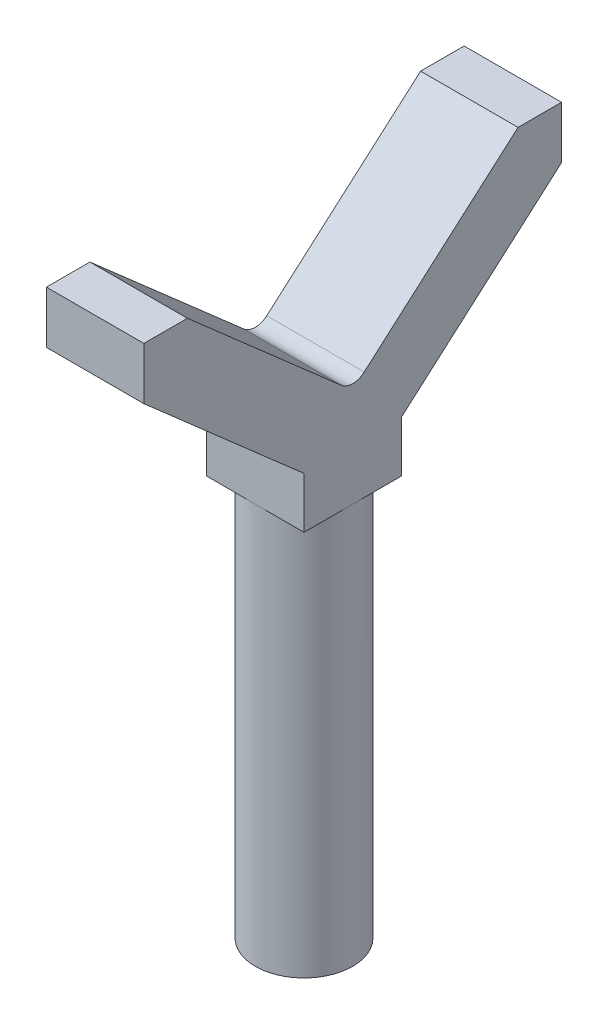
ISO-10303-21;
HEADER;
FILE_DESCRIPTION(('STEP AP214'),'2;1');
FILE_NAME('part.step','',(''),(''),'','','');
FILE_SCHEMA(('AUTOMOTIVE_DESIGN { 1 0 10303 214 1 1 1 1 }'));
ENDSEC;
DATA;
#1=APPLICATION_CONTEXT('core data for automotive mechanical design processes');
#2=APPLICATION_PROTOCOL_DEFINITION('international standard','automotive_design',2000,#1);
#3=PRODUCT_CONTEXT('',#1,'mechanical');
#4=PRODUCT('Part','Part','',(#3));
#5=PRODUCT_RELATED_PRODUCT_CATEGORY('part','',(#4));
#6=PRODUCT_DEFINITION_FORMATION('','',#4);
#7=PRODUCT_DEFINITION_CONTEXT('part definition',#1,'design');
#8=PRODUCT_DEFINITION('design','',#6,#7);
#9=PRODUCT_DEFINITION_SHAPE('','',#8);
#10=(LENGTH_UNIT() NAMED_UNIT(*) SI_UNIT(.MILLI.,.METRE.));
#11=(NAMED_UNIT(*) PLANE_ANGLE_UNIT() SI_UNIT($,.RADIAN.));
#12=(NAMED_UNIT(*) SI_UNIT($,.STERADIAN.) SOLID_ANGLE_UNIT());
#13=UNCERTAINTY_MEASURE_WITH_UNIT(LENGTH_MEASURE(1.E-05),#10,'distance_accuracy_value','');
#14=(GEOMETRIC_REPRESENTATION_CONTEXT(3) GLOBAL_UNCERTAINTY_ASSIGNED_CONTEXT((#13)) GLOBAL_UNIT_ASSIGNED_CONTEXT((#10,
#11,#12)) REPRESENTATION_CONTEXT('',''));
#15=CARTESIAN_POINT('',(0.,0.,0.));
#16=DIRECTION('',(0.,0.,1.));
#17=DIRECTION('',(1.,0.,0.));
#18=AXIS2_PLACEMENT_3D('',#15,#16,#17);
#19=CARTESIAN_POINT('',(0.,230.,0.));
#20=DIRECTION('',(0.,-1.,0.));
#21=DIRECTION('',(0.,0.,-1.));
#22=AXIS2_PLACEMENT_3D('',#19,#20,#21);
#23=CYLINDRICAL_SURFACE('',#22,28.);
#24=CARTESIAN_POINT('',(0.,230.,0.));
#25=DIRECTION('',(0.,1.,0.));
#26=DIRECTION('',(0.,0.,1.));
#27=AXIS2_PLACEMENT_3D('',#24,#25,#26);
#28=CIRCLE('',#27,28.);
#29=CARTESIAN_POINT('',(0.,230.,28.));
#30=VERTEX_POINT('',#29);
#31=CARTESIAN_POINT('',(28.,230.,0.));
#32=VERTEX_POINT('',#31);
#33=EDGE_CURVE('E11',#30,#32,#28,.T.);
#34=ORIENTED_EDGE('',*,*,#33,.F.);
#35=CARTESIAN_POINT('',(-28.,230.,0.));
#36=VERTEX_POINT('',#35);
#37=EDGE_CURVE('E45',#36,#30,#28,.T.);
#38=ORIENTED_EDGE('',*,*,#37,.F.);
#39=CARTESIAN_POINT('',(0.,230.,-28.));
#40=VERTEX_POINT('',#39);
#41=EDGE_CURVE('E55',#40,#36,#28,.T.);
#42=ORIENTED_EDGE('',*,*,#41,.F.);
#43=EDGE_CURVE('E44',#32,#40,#28,.T.);
#44=ORIENTED_EDGE('',*,*,#43,.F.);
#45=EDGE_LOOP('',(#34,#38,#42,#44));
#46=FACE_BOUND('',#45,.T.);
#47=CARTESIAN_POINT('',(0.,0.,0.));
#48=DIRECTION('',(0.,1.,0.));
#49=DIRECTION('',(0.,0.,1.));
#50=AXIS2_PLACEMENT_3D('',#47,#48,#49);
#51=CIRCLE('',#50,28.);
#52=CARTESIAN_POINT('',(0.,0.,28.));
#53=VERTEX_POINT('',#52);
#54=EDGE_CURVE('E39',#53,#53,#51,.T.);
#55=ORIENTED_EDGE('',*,*,#54,.T.);
#56=EDGE_LOOP('',(#55));
#57=FACE_BOUND('',#56,.T.);
#58=ADVANCED_FACE('F36',(#46,#57),#23,.T.);
#59=CARTESIAN_POINT('',(0.,0.,0.));
#60=DIRECTION('',(0.,1.,0.));
#61=DIRECTION('',(0.,0.,1.));
#62=AXIS2_PLACEMENT_3D('',#59,#60,#61);
#63=PLANE('',#62);
#64=ORIENTED_EDGE('',*,*,#54,.F.);
#65=EDGE_LOOP('',(#64));
#66=FACE_BOUND('',#65,.T.);
#67=ADVANCED_FACE('F308',(#66),#63,.F.);
#68=CARTESIAN_POINT('',(28.,230.,-28.));
#69=DIRECTION('',(0.,1.,0.));
#70=DIRECTION('',(0.,0.,1.));
#71=AXIS2_PLACEMENT_3D('',#68,#69,#70);
#72=PLANE('',#71);
#73=DIRECTION('',(-1.,0.,0.));
#74=VECTOR('',#73,1.);
#75=CARTESIAN_POINT('',(28.,230.,28.));
#76=LINE('',#75,#74);
#77=CARTESIAN_POINT('',(28.,230.,28.));
#78=VERTEX_POINT('',#77);
#79=EDGE_CURVE('E173',#78,#30,#76,.T.);
#80=ORIENTED_EDGE('',*,*,#79,.T.);
#81=ORIENTED_EDGE('',*,*,#33,.T.);
#82=DIRECTION('',(0.,0.,-1.));
#83=VECTOR('',#82,1.);
#84=CARTESIAN_POINT('',(28.,230.,-28.));
#85=LINE('',#84,#83);
#86=EDGE_CURVE('E229',#78,#32,#85,.T.);
#87=ORIENTED_EDGE('',*,*,#86,.F.);
#88=EDGE_LOOP('',(#80,#81,#87));
#89=FACE_BOUND('',#88,.T.);
#90=ADVANCED_FACE('F260',(#89),#72,.F.);
#91=CARTESIAN_POINT('',(28.,230.,-28.));
#92=VERTEX_POINT('',#91);
#93=EDGE_CURVE('E232',#32,#92,#85,.T.);
#94=ORIENTED_EDGE('',*,*,#93,.F.);
#95=ORIENTED_EDGE('',*,*,#43,.T.);
#96=DIRECTION('',(-1.,0.,0.));
#97=VECTOR('',#96,1.);
#98=CARTESIAN_POINT('',(28.,230.,-28.));
#99=LINE('',#98,#97);
#100=EDGE_CURVE('E177',#92,#40,#99,.T.);
#101=ORIENTED_EDGE('',*,*,#100,.F.);
#102=EDGE_LOOP('',(#94,#95,#101));
#103=FACE_BOUND('',#102,.T.);
#104=ADVANCED_FACE('F264',(#103),#72,.F.);
#105=CARTESIAN_POINT('',(-28.,230.,-28.));
#106=VERTEX_POINT('',#105);
#107=EDGE_CURVE('E180',#40,#106,#99,.T.);
#108=ORIENTED_EDGE('',*,*,#107,.F.);
#109=ORIENTED_EDGE('',*,*,#41,.T.);
#110=DIRECTION('',(0.,0.,-1.));
#111=VECTOR('',#110,1.);
#112=CARTESIAN_POINT('',(-28.,230.,-28.));
#113=LINE('',#112,#111);
#114=EDGE_CURVE('E207',#36,#106,#113,.T.);
#115=ORIENTED_EDGE('',*,*,#114,.T.);
#116=EDGE_LOOP('',(#108,#109,#115));
#117=FACE_BOUND('',#116,.T.);
#118=ADVANCED_FACE('F298',(#117),#72,.F.);
#119=CARTESIAN_POINT('',(-28.,230.,28.));
#120=VERTEX_POINT('',#119);
#121=EDGE_CURVE('E204',#120,#36,#113,.T.);
#122=ORIENTED_EDGE('',*,*,#121,.T.);
#123=ORIENTED_EDGE('',*,*,#37,.T.);
#124=EDGE_CURVE('E176',#30,#120,#76,.T.);
#125=ORIENTED_EDGE('',*,*,#124,.T.);
#126=EDGE_LOOP('',(#122,#123,#125));
#127=FACE_BOUND('',#126,.T.);
#128=ADVANCED_FACE('F296',(#127),#72,.F.);
#129=CARTESIAN_POINT('',(28.,300.,0.));
#130=DIRECTION('',(-1.,0.,0.));
#131=DIRECTION('',(0.,0.,1.));
#132=AXIS2_PLACEMENT_3D('',#129,#130,#131);
#133=CYLINDRICAL_SURFACE('',#132,10.0000000000001);
#134=CARTESIAN_POINT('',(-28.,300.,0.));
#135=DIRECTION('',(-1.,0.,0.));
#136=DIRECTION('',(0.,0.,-1.));
#137=AXIS2_PLACEMENT_3D('',#134,#135,#136);
#138=CIRCLE('',#137,10.0000000000001);
#139=CARTESIAN_POINT('',(-28.,292.481093561587,-6.59287842830408));
#140=VERTEX_POINT('',#139);
#141=CARTESIAN_POINT('',(-28.,292.481093561587,6.59287842830408));
#142=VERTEX_POINT('',#141);
#143=EDGE_CURVE('E159',#140,#142,#138,.T.);
#144=ORIENTED_EDGE('',*,*,#143,.T.);
#145=DIRECTION('',(-1.,0.,0.));
#146=VECTOR('',#145,1.);
#147=CARTESIAN_POINT('',(28.,292.481093561587,6.59287842830408));
#148=LINE('',#147,#146);
#149=CARTESIAN_POINT('',(28.,292.481093561587,6.59287842830408));
#150=VERTEX_POINT('',#149);
#151=EDGE_CURVE('E139',#150,#142,#148,.T.);
#152=ORIENTED_EDGE('',*,*,#151,.F.);
#153=CARTESIAN_POINT('',(28.,300.,0.));
#154=DIRECTION('',(-1.,0.,0.));
#155=DIRECTION('',(0.,0.,-1.));
#156=AXIS2_PLACEMENT_3D('',#153,#154,#155);
#157=CIRCLE('',#156,10.0000000000001);
#158=CARTESIAN_POINT('',(28.,292.481093561587,-6.59287842830408));
#159=VERTEX_POINT('',#158);
#160=EDGE_CURVE('E146',#159,#150,#157,.T.);
#161=ORIENTED_EDGE('',*,*,#160,.F.);
#162=DIRECTION('',(-1.,0.,0.));
#163=VECTOR('',#162,1.);
#164=CARTESIAN_POINT('',(28.,292.481093561587,-6.59287842830408));
#165=LINE('',#164,#163);
#166=EDGE_CURVE('E193',#159,#140,#165,.T.);
#167=ORIENTED_EDGE('',*,*,#166,.T.);
#168=EDGE_LOOP('',(#144,#152,#161,#167));
#169=FACE_BOUND('',#168,.T.);
#170=ADVANCED_FACE('F157',(#169),#133,.F.);
#171=CARTESIAN_POINT('',(28.,292.481093561587,6.59287842830408));
#172=DIRECTION('',(0.,-0.751890643841264,0.659287842830406));
#173=DIRECTION('',(0.,-0.659287842830406,-0.751890643841264));
#174=AXIS2_PLACEMENT_3D('',#171,#172,#173);
#175=PLANE('',#174);
#176=DIRECTION('',(0.,0.659287842830406,0.751890643841264));
#177=VECTOR('',#176,1.);
#178=CARTESIAN_POINT('',(-28.,292.481093561587,6.59287842830408));
#179=LINE('',#178,#177);
#180=CARTESIAN_POINT('',(-28.,370.,95.));
#181=VERTEX_POINT('',#180);
#182=EDGE_CURVE('E217',#142,#181,#179,.T.);
#183=ORIENTED_EDGE('',*,*,#182,.T.);
#184=DIRECTION('',(-1.,0.,0.));
#185=VECTOR('',#184,1.);
#186=CARTESIAN_POINT('',(28.,370.,95.));
#187=LINE('',#186,#185);
#188=CARTESIAN_POINT('',(28.,370.,95.));
#189=VERTEX_POINT('',#188);
#190=EDGE_CURVE('E142',#189,#181,#187,.T.);
#191=ORIENTED_EDGE('',*,*,#190,.F.);
#192=DIRECTION('',(0.,0.659287842830406,0.751890643841264));
#193=VECTOR('',#192,1.);
#194=CARTESIAN_POINT('',(28.,292.481093561587,6.59287842830408));
#195=LINE('',#194,#193);
#196=EDGE_CURVE('E135',#150,#189,#195,.T.);
#197=ORIENTED_EDGE('',*,*,#196,.F.);
#198=ORIENTED_EDGE('',*,*,#151,.T.);
#199=EDGE_LOOP('',(#183,#191,#197,#198));
#200=FACE_BOUND('',#199,.T.);
#201=ADVANCED_FACE('F137',(#200),#175,.F.);
#202=CARTESIAN_POINT('',(28.,370.,95.));
#203=DIRECTION('',(0.,-1.,0.));
#204=DIRECTION('',(0.,0.,-1.));
#205=AXIS2_PLACEMENT_3D('',#202,#203,#204);
#206=PLANE('',#205);
#207=DIRECTION('',(0.,0.,1.));
#208=VECTOR('',#207,1.);
#209=CARTESIAN_POINT('',(-28.,370.,95.));
#210=LINE('',#209,#208);
#211=CARTESIAN_POINT('',(-28.,370.,120.));
#212=VERTEX_POINT('',#211);
#213=EDGE_CURVE('E215',#181,#212,#210,.T.);
#214=ORIENTED_EDGE('',*,*,#213,.T.);
#215=DIRECTION('',(-1.,0.,0.));
#216=VECTOR('',#215,1.);
#217=CARTESIAN_POINT('',(28.,370.,120.));
#218=LINE('',#217,#216);
#219=CARTESIAN_POINT('',(28.,370.,120.));
#220=VERTEX_POINT('',#219);
#221=EDGE_CURVE('E162',#220,#212,#218,.T.);
#222=ORIENTED_EDGE('',*,*,#221,.F.);
#223=DIRECTION('',(0.,0.,1.));
#224=VECTOR('',#223,1.);
#225=CARTESIAN_POINT('',(28.,370.,95.));
#226=LINE('',#225,#224);
#227=EDGE_CURVE('E145',#189,#220,#226,.T.);
#228=ORIENTED_EDGE('',*,*,#227,.F.);
#229=ORIENTED_EDGE('',*,*,#190,.T.);
#230=EDGE_LOOP('',(#214,#222,#228,#229));
#231=FACE_BOUND('',#230,.T.);
#232=ADVANCED_FACE('F243',(#231),#206,.F.);
#233=CARTESIAN_POINT('',(28.,370.,120.));
#234=DIRECTION('',(0.,0.,-1.));
#235=DIRECTION('',(0.,1.,0.));
#236=AXIS2_PLACEMENT_3D('',#233,#234,#235);
#237=PLANE('',#236);
#238=DIRECTION('',(0.,-1.,0.));
#239=VECTOR('',#238,1.);
#240=CARTESIAN_POINT('',(-28.,370.,120.));
#241=LINE('',#240,#239);
#242=CARTESIAN_POINT('',(-28.,340.,120.));
#243=VERTEX_POINT('',#242);
#244=EDGE_CURVE('E213',#212,#243,#241,.T.);
#245=ORIENTED_EDGE('',*,*,#244,.T.);
#246=DIRECTION('',(-1.,0.,0.));
#247=VECTOR('',#246,1.);
#248=CARTESIAN_POINT('',(28.,340.,120.));
#249=LINE('',#248,#247);
#250=CARTESIAN_POINT('',(28.,340.,120.));
#251=VERTEX_POINT('',#250);
#252=EDGE_CURVE('E167',#251,#243,#249,.T.);
#253=ORIENTED_EDGE('',*,*,#252,.F.);
#254=DIRECTION('',(0.,-1.,0.));
#255=VECTOR('',#254,1.);
#256=CARTESIAN_POINT('',(28.,370.,120.));
#257=LINE('',#256,#255);
#258=EDGE_CURVE('E237',#220,#251,#257,.T.);
#259=ORIENTED_EDGE('',*,*,#258,.F.);
#260=ORIENTED_EDGE('',*,*,#221,.T.);
#261=EDGE_LOOP('',(#245,#253,#259,#260));
#262=FACE_BOUND('',#261,.T.);
#263=ADVANCED_FACE('F247',(#262),#237,.F.);
#264=CARTESIAN_POINT('',(28.,340.,120.));
#265=DIRECTION('',(0.,0.751890643841264,-0.659287842830406));
#266=DIRECTION('',(0.,0.659287842830406,0.751890643841264));
#267=AXIS2_PLACEMENT_3D('',#264,#265,#266);
#268=PLANE('',#267);
#269=DIRECTION('',(0.,-0.659287842830406,-0.751890643841264));
#270=VECTOR('',#269,1.);
#271=CARTESIAN_POINT('',(-28.,340.,120.));
#272=LINE('',#271,#270);
#273=CARTESIAN_POINT('',(-28.,259.330713798319,28.));
#274=VERTEX_POINT('',#273);
#275=EDGE_CURVE('E211',#243,#274,#272,.T.);
#276=ORIENTED_EDGE('',*,*,#275,.T.);
#277=DIRECTION('',(-1.,0.,0.));
#278=VECTOR('',#277,1.);
#279=CARTESIAN_POINT('',(28.,259.330713798319,28.));
#280=LINE('',#279,#278);
#281=CARTESIAN_POINT('',(28.,259.330713798319,28.));
#282=VERTEX_POINT('',#281);
#283=EDGE_CURVE('E170',#282,#274,#280,.T.);
#284=ORIENTED_EDGE('',*,*,#283,.F.);
#285=DIRECTION('',(0.,-0.659287842830406,-0.751890643841264));
#286=VECTOR('',#285,1.);
#287=CARTESIAN_POINT('',(28.,340.,120.));
#288=LINE('',#287,#286);
#289=EDGE_CURVE('E235',#251,#282,#288,.T.);
#290=ORIENTED_EDGE('',*,*,#289,.F.);
#291=ORIENTED_EDGE('',*,*,#252,.T.);
#292=EDGE_LOOP('',(#276,#284,#290,#291));
#293=FACE_BOUND('',#292,.T.);
#294=ADVANCED_FACE('F252',(#293),#268,.F.);
#295=CARTESIAN_POINT('',(28.,230.,28.));
#296=DIRECTION('',(0.,0.,-1.));
#297=DIRECTION('',(0.,1.,0.));
#298=AXIS2_PLACEMENT_3D('',#295,#296,#297);
#299=PLANE('',#298);
#300=DIRECTION('',(0.,-1.,0.));
#301=VECTOR('',#300,1.);
#302=CARTESIAN_POINT('',(-28.,230.,28.));
#303=LINE('',#302,#301);
#304=EDGE_CURVE('E208',#274,#120,#303,.T.);
#305=ORIENTED_EDGE('',*,*,#304,.T.);
#306=ORIENTED_EDGE('',*,*,#124,.F.);
#307=ORIENTED_EDGE('',*,*,#79,.F.);
#308=DIRECTION('',(0.,-1.,0.));
#309=VECTOR('',#308,1.);
#310=CARTESIAN_POINT('',(28.,230.,28.));
#311=LINE('',#310,#309);
#312=EDGE_CURVE('E233',#282,#78,#311,.T.);
#313=ORIENTED_EDGE('',*,*,#312,.F.);
#314=ORIENTED_EDGE('',*,*,#283,.T.);
#315=EDGE_LOOP('',(#305,#306,#307,#313,#314));
#316=FACE_BOUND('',#315,.T.);
#317=ADVANCED_FACE('F258',(#316),#299,.F.);
#318=CARTESIAN_POINT('',(28.,259.330713798319,-28.));
#319=DIRECTION('',(0.,0.,1.));
#320=DIRECTION('',(0.,-1.,0.));
#321=AXIS2_PLACEMENT_3D('',#318,#319,#320);
#322=PLANE('',#321);
#323=DIRECTION('',(0.,1.,0.));
#324=VECTOR('',#323,1.);
#325=CARTESIAN_POINT('',(-28.,259.330713798319,-28.));
#326=LINE('',#325,#324);
#327=CARTESIAN_POINT('',(-28.,259.330713798319,-28.));
#328=VERTEX_POINT('',#327);
#329=EDGE_CURVE('E202',#106,#328,#326,.T.);
#330=ORIENTED_EDGE('',*,*,#329,.T.);
#331=DIRECTION('',(-1.,0.,0.));
#332=VECTOR('',#331,1.);
#333=CARTESIAN_POINT('',(28.,259.330713798319,-28.));
#334=LINE('',#333,#332);
#335=CARTESIAN_POINT('',(28.,259.330713798319,-28.));
#336=VERTEX_POINT('',#335);
#337=EDGE_CURVE('E181',#336,#328,#334,.T.);
#338=ORIENTED_EDGE('',*,*,#337,.F.);
#339=DIRECTION('',(0.,1.,0.));
#340=VECTOR('',#339,1.);
#341=CARTESIAN_POINT('',(28.,259.330713798319,-28.));
#342=LINE('',#341,#340);
#343=EDGE_CURVE('E227',#92,#336,#342,.T.);
#344=ORIENTED_EDGE('',*,*,#343,.F.);
#345=ORIENTED_EDGE('',*,*,#100,.T.);
#346=ORIENTED_EDGE('',*,*,#107,.T.);
#347=EDGE_LOOP('',(#330,#338,#344,#345,#346));
#348=FACE_BOUND('',#347,.T.);
#349=ADVANCED_FACE('F271',(#348),#322,.F.);
#350=CARTESIAN_POINT('',(28.,340.,-120.));
#351=DIRECTION('',(0.,0.751890643841264,0.659287842830406));
#352=DIRECTION('',(0.,-0.659287842830406,0.751890643841264));
#353=AXIS2_PLACEMENT_3D('',#350,#351,#352);
#354=PLANE('',#353);
#355=DIRECTION('',(0.,0.659287842830406,-0.751890643841264));
#356=VECTOR('',#355,1.);
#357=CARTESIAN_POINT('',(-28.,340.,-120.));
#358=LINE('',#357,#356);
#359=CARTESIAN_POINT('',(-28.,340.,-120.));
#360=VERTEX_POINT('',#359);
#361=EDGE_CURVE('E200',#328,#360,#358,.T.);
#362=ORIENTED_EDGE('',*,*,#361,.T.);
#363=DIRECTION('',(-1.,0.,0.));
#364=VECTOR('',#363,1.);
#365=CARTESIAN_POINT('',(28.,340.,-120.));
#366=LINE('',#365,#364);
#367=CARTESIAN_POINT('',(28.,340.,-120.));
#368=VERTEX_POINT('',#367);
#369=EDGE_CURVE('E184',#368,#360,#366,.T.);
#370=ORIENTED_EDGE('',*,*,#369,.F.);
#371=DIRECTION('',(0.,0.659287842830406,-0.751890643841264));
#372=VECTOR('',#371,1.);
#373=CARTESIAN_POINT('',(28.,340.,-120.));
#374=LINE('',#373,#372);
#375=EDGE_CURVE('E225',#336,#368,#374,.T.);
#376=ORIENTED_EDGE('',*,*,#375,.F.);
#377=ORIENTED_EDGE('',*,*,#337,.T.);
#378=EDGE_LOOP('',(#362,#370,#376,#377));
#379=FACE_BOUND('',#378,.T.);
#380=ADVANCED_FACE('F275',(#379),#354,.F.);
#381=CARTESIAN_POINT('',(28.,370.,-120.));
#382=DIRECTION('',(0.,0.,1.));
#383=DIRECTION('',(0.,-1.,0.));
#384=AXIS2_PLACEMENT_3D('',#381,#382,#383);
#385=PLANE('',#384);
#386=DIRECTION('',(0.,1.,0.));
#387=VECTOR('',#386,1.);
#388=CARTESIAN_POINT('',(-28.,370.,-120.));
#389=LINE('',#388,#387);
#390=CARTESIAN_POINT('',(-28.,370.,-120.));
#391=VERTEX_POINT('',#390);
#392=EDGE_CURVE('E198',#360,#391,#389,.T.);
#393=ORIENTED_EDGE('',*,*,#392,.T.);
#394=DIRECTION('',(-1.,0.,0.));
#395=VECTOR('',#394,1.);
#396=CARTESIAN_POINT('',(28.,370.,-120.));
#397=LINE('',#396,#395);
#398=CARTESIAN_POINT('',(28.,370.,-120.));
#399=VERTEX_POINT('',#398);
#400=EDGE_CURVE('E187',#399,#391,#397,.T.);
#401=ORIENTED_EDGE('',*,*,#400,.F.);
#402=DIRECTION('',(0.,1.,0.));
#403=VECTOR('',#402,1.);
#404=CARTESIAN_POINT('',(28.,370.,-120.));
#405=LINE('',#404,#403);
#406=EDGE_CURVE('E223',#368,#399,#405,.T.);
#407=ORIENTED_EDGE('',*,*,#406,.F.);
#408=ORIENTED_EDGE('',*,*,#369,.T.);
#409=EDGE_LOOP('',(#393,#401,#407,#408));
#410=FACE_BOUND('',#409,.T.);
#411=ADVANCED_FACE('F280',(#410),#385,.F.);
#412=CARTESIAN_POINT('',(28.,370.,-95.));
#413=DIRECTION('',(0.,-1.,0.));
#414=DIRECTION('',(0.,0.,-1.));
#415=AXIS2_PLACEMENT_3D('',#412,#413,#414);
#416=PLANE('',#415);
#417=DIRECTION('',(0.,0.,1.));
#418=VECTOR('',#417,1.);
#419=CARTESIAN_POINT('',(-28.,370.,-95.));
#420=LINE('',#419,#418);
#421=CARTESIAN_POINT('',(-28.,370.,-95.));
#422=VERTEX_POINT('',#421);
#423=EDGE_CURVE('E196',#391,#422,#420,.T.);
#424=ORIENTED_EDGE('',*,*,#423,.T.);
#425=DIRECTION('',(-1.,0.,0.));
#426=VECTOR('',#425,1.);
#427=CARTESIAN_POINT('',(28.,370.,-95.));
#428=LINE('',#427,#426);
#429=CARTESIAN_POINT('',(28.,370.,-95.));
#430=VERTEX_POINT('',#429);
#431=EDGE_CURVE('E190',#430,#422,#428,.T.);
#432=ORIENTED_EDGE('',*,*,#431,.F.);
#433=DIRECTION('',(0.,0.,1.));
#434=VECTOR('',#433,1.);
#435=CARTESIAN_POINT('',(28.,370.,-95.));
#436=LINE('',#435,#434);
#437=EDGE_CURVE('E221',#399,#430,#436,.T.);
#438=ORIENTED_EDGE('',*,*,#437,.F.);
#439=ORIENTED_EDGE('',*,*,#400,.T.);
#440=EDGE_LOOP('',(#424,#432,#438,#439));
#441=FACE_BOUND('',#440,.T.);
#442=ADVANCED_FACE('F284',(#441),#416,.F.);
#443=CARTESIAN_POINT('',(28.,292.481093561587,-6.59287842830408));
#444=DIRECTION('',(0.,-0.751890643841264,-0.659287842830406));
#445=DIRECTION('',(0.,0.659287842830406,-0.751890643841264));
#446=AXIS2_PLACEMENT_3D('',#443,#444,#445);
#447=PLANE('',#446);
#448=DIRECTION('',(0.,-0.659287842830406,0.751890643841264));
#449=VECTOR('',#448,1.);
#450=CARTESIAN_POINT('',(-28.,292.481093561587,-6.59287842830408));
#451=LINE('',#450,#449);
#452=EDGE_CURVE('E155',#422,#140,#451,.T.);
#453=ORIENTED_EDGE('',*,*,#452,.T.);
#454=ORIENTED_EDGE('',*,*,#166,.F.);
#455=DIRECTION('',(0.,-0.659287842830406,0.751890643841264));
#456=VECTOR('',#455,1.);
#457=CARTESIAN_POINT('',(28.,292.481093561587,-6.59287842830408));
#458=LINE('',#457,#456);
#459=EDGE_CURVE('E151',#430,#159,#458,.T.);
#460=ORIENTED_EDGE('',*,*,#459,.F.);
#461=ORIENTED_EDGE('',*,*,#431,.T.);
#462=EDGE_LOOP('',(#453,#454,#460,#461));
#463=FACE_BOUND('',#462,.T.);
#464=ADVANCED_FACE('F288',(#463),#447,.F.);
#465=CARTESIAN_POINT('',(28.,300.,0.));
#466=DIRECTION('',(1.,0.,0.));
#467=DIRECTION('',(0.,0.,-1.));
#468=AXIS2_PLACEMENT_3D('',#465,#466,#467);
#469=PLANE('',#468);
#470=ORIENTED_EDGE('',*,*,#160,.T.);
#471=ORIENTED_EDGE('',*,*,#196,.T.);
#472=ORIENTED_EDGE('',*,*,#227,.T.);
#473=ORIENTED_EDGE('',*,*,#258,.T.);
#474=ORIENTED_EDGE('',*,*,#289,.T.);
#475=ORIENTED_EDGE('',*,*,#312,.T.);
#476=ORIENTED_EDGE('',*,*,#86,.T.);
#477=ORIENTED_EDGE('',*,*,#93,.T.);
#478=ORIENTED_EDGE('',*,*,#343,.T.);
#479=ORIENTED_EDGE('',*,*,#375,.T.);
#480=ORIENTED_EDGE('',*,*,#406,.T.);
#481=ORIENTED_EDGE('',*,*,#437,.T.);
#482=ORIENTED_EDGE('',*,*,#459,.T.);
#483=EDGE_LOOP('',(#470,#471,#472,#473,#474,#475,#476,#477,#478,#479,#480,#481,#482));
#484=FACE_BOUND('',#483,.T.);
#485=ADVANCED_FACE('F149',(#484),#469,.T.);
#486=CARTESIAN_POINT('',(-28.,300.,0.));
#487=DIRECTION('',(1.,0.,0.));
#488=DIRECTION('',(0.,0.,-1.));
#489=AXIS2_PLACEMENT_3D('',#486,#487,#488);
#490=PLANE('',#489);
#491=ORIENTED_EDGE('',*,*,#143,.F.);
#492=ORIENTED_EDGE('',*,*,#452,.F.);
#493=ORIENTED_EDGE('',*,*,#423,.F.);
#494=ORIENTED_EDGE('',*,*,#392,.F.);
#495=ORIENTED_EDGE('',*,*,#361,.F.);
#496=ORIENTED_EDGE('',*,*,#329,.F.);
#497=ORIENTED_EDGE('',*,*,#114,.F.);
#498=ORIENTED_EDGE('',*,*,#121,.F.);
#499=ORIENTED_EDGE('',*,*,#304,.F.);
#500=ORIENTED_EDGE('',*,*,#275,.F.);
#501=ORIENTED_EDGE('',*,*,#244,.F.);
#502=ORIENTED_EDGE('',*,*,#213,.F.);
#503=ORIENTED_EDGE('',*,*,#182,.F.);
#504=EDGE_LOOP('',(#491,#492,#493,#494,#495,#496,#497,#498,#499,#500,#501,#502,#503));
#505=FACE_BOUND('',#504,.T.);
#506=ADVANCED_FACE('F290',(#505),#490,.F.);
#507=CLOSED_SHELL('',(#58,#67,#90,#104,#118,#128,#170,#201,#232,#263,#294,#317,#349,#380,#411,
#442,#464,#485,#506));
#508=MANIFOLD_SOLID_BREP('B2',#507);
#509=ADVANCED_BREP_SHAPE_REPRESENTATION('',(#18,#508),#14);
#510=SHAPE_DEFINITION_REPRESENTATION(#9,#509);
ENDSEC;
END-ISO-10303-21;
